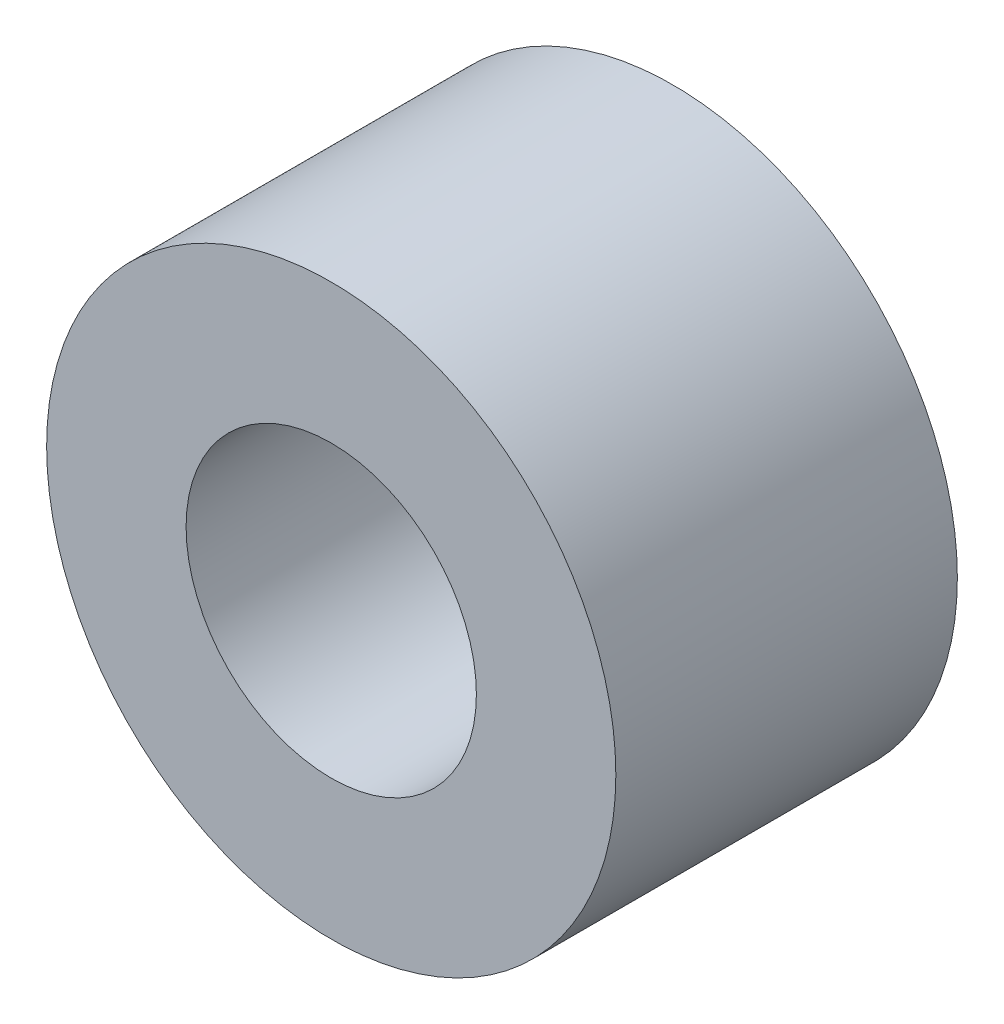
ISO-10303-21;
HEADER;
FILE_DESCRIPTION(('STEP AP214'),'2;1');
FILE_NAME('part.step','',(''),(''),'','','');
FILE_SCHEMA(('AUTOMOTIVE_DESIGN { 1 0 10303 214 1 1 1 1 }'));
ENDSEC;
DATA;
#1=APPLICATION_CONTEXT('core data for automotive mechanical design processes');
#2=APPLICATION_PROTOCOL_DEFINITION('international standard','automotive_design',2000,#1);
#3=PRODUCT_CONTEXT('',#1,'mechanical');
#4=PRODUCT('Part','Part','',(#3));
#5=PRODUCT_RELATED_PRODUCT_CATEGORY('part','',(#4));
#6=PRODUCT_DEFINITION_FORMATION('','',#4);
#7=PRODUCT_DEFINITION_CONTEXT('part definition',#1,'design');
#8=PRODUCT_DEFINITION('design','',#6,#7);
#9=PRODUCT_DEFINITION_SHAPE('','',#8);
#10=(LENGTH_UNIT() NAMED_UNIT(*) SI_UNIT(.MILLI.,.METRE.));
#11=(NAMED_UNIT(*) PLANE_ANGLE_UNIT() SI_UNIT($,.RADIAN.));
#12=(NAMED_UNIT(*) SI_UNIT($,.STERADIAN.) SOLID_ANGLE_UNIT());
#13=UNCERTAINTY_MEASURE_WITH_UNIT(LENGTH_MEASURE(1.E-05),#10,'distance_accuracy_value','');
#14=(GEOMETRIC_REPRESENTATION_CONTEXT(3) GLOBAL_UNCERTAINTY_ASSIGNED_CONTEXT((#13)) GLOBAL_UNIT_ASSIGNED_CONTEXT((#10,
#11,#12)) REPRESENTATION_CONTEXT('',''));
#15=CARTESIAN_POINT('',(0.,0.,0.));
#16=DIRECTION('',(0.,0.,1.));
#17=DIRECTION('',(1.,0.,0.));
#18=AXIS2_PLACEMENT_3D('',#15,#16,#17);
#19=CARTESIAN_POINT('',(0.,0.,6.));
#20=DIRECTION('',(0.,0.,1.));
#21=DIRECTION('',(1.,0.,0.));
#22=AXIS2_PLACEMENT_3D('',#19,#20,#21);
#23=PLANE('',#22);
#24=CARTESIAN_POINT('',(0.,0.,6.));
#25=DIRECTION('',(0.,0.,1.));
#26=DIRECTION('',(1.,0.,0.));
#27=AXIS2_PLACEMENT_3D('',#24,#25,#26);
#28=CIRCLE('',#27,5.);
#29=CARTESIAN_POINT('',(5.,0.,6.));
#30=VERTEX_POINT('',#29);
#31=EDGE_CURVE('E10',#30,#30,#28,.T.);
#32=ORIENTED_EDGE('',*,*,#31,.T.);
#33=EDGE_LOOP('',(#32));
#34=FACE_BOUND('',#33,.T.);
#35=CARTESIAN_POINT('',(0.,0.,6.));
#36=DIRECTION('',(0.,0.,1.));
#37=DIRECTION('',(1.,0.,0.));
#38=AXIS2_PLACEMENT_3D('',#35,#36,#37);
#39=CIRCLE('',#38,2.55);
#40=CARTESIAN_POINT('',(2.55,0.,6.));
#41=VERTEX_POINT('',#40);
#42=EDGE_CURVE('E53',#41,#41,#39,.T.);
#43=ORIENTED_EDGE('',*,*,#42,.F.);
#44=EDGE_LOOP('',(#43));
#45=FACE_BOUND('',#44,.T.);
#46=ADVANCED_FACE('F40',(#34,#45),#23,.T.);
#47=CARTESIAN_POINT('',(0.,0.,0.));
#48=DIRECTION('',(0.,0.,1.));
#49=DIRECTION('',(1.,0.,0.));
#50=AXIS2_PLACEMENT_3D('',#47,#48,#49);
#51=PLANE('',#50);
#52=CARTESIAN_POINT('',(0.,0.,0.));
#53=DIRECTION('',(0.,0.,1.));
#54=DIRECTION('',(1.,0.,0.));
#55=AXIS2_PLACEMENT_3D('',#52,#53,#54);
#56=CIRCLE('',#55,5.);
#57=CARTESIAN_POINT('',(5.,0.,0.));
#58=VERTEX_POINT('',#57);
#59=EDGE_CURVE('E44',#58,#58,#56,.T.);
#60=ORIENTED_EDGE('',*,*,#59,.F.);
#61=EDGE_LOOP('',(#60));
#62=FACE_BOUND('',#61,.T.);
#63=CARTESIAN_POINT('',(0.,0.,0.));
#64=DIRECTION('',(0.,0.,1.));
#65=DIRECTION('',(1.,0.,0.));
#66=AXIS2_PLACEMENT_3D('',#63,#64,#65);
#67=CIRCLE('',#66,2.55);
#68=CARTESIAN_POINT('',(2.55,0.,0.));
#69=VERTEX_POINT('',#68);
#70=EDGE_CURVE('E55',#69,#69,#67,.T.);
#71=ORIENTED_EDGE('',*,*,#70,.T.);
#72=EDGE_LOOP('',(#71));
#73=FACE_BOUND('',#72,.T.);
#74=ADVANCED_FACE('F67',(#62,#73),#51,.F.);
#75=CARTESIAN_POINT('',(0.,0.,6.));
#76=DIRECTION('',(0.,0.,-1.));
#77=DIRECTION('',(-1.,0.,0.));
#78=AXIS2_PLACEMENT_3D('',#75,#76,#77);
#79=CYLINDRICAL_SURFACE('',#78,5.);
#80=ORIENTED_EDGE('',*,*,#31,.F.);
#81=EDGE_LOOP('',(#80));
#82=FACE_BOUND('',#81,.T.);
#83=ORIENTED_EDGE('',*,*,#59,.T.);
#84=EDGE_LOOP('',(#83));
#85=FACE_BOUND('',#84,.T.);
#86=ADVANCED_FACE('F42',(#82,#85),#79,.T.);
#87=CARTESIAN_POINT('',(0.,0.,6.));
#88=DIRECTION('',(0.,0.,-1.));
#89=DIRECTION('',(-1.,0.,0.));
#90=AXIS2_PLACEMENT_3D('',#87,#88,#89);
#91=CYLINDRICAL_SURFACE('',#90,2.55);
#92=ORIENTED_EDGE('',*,*,#42,.T.);
#93=EDGE_LOOP('',(#92));
#94=FACE_BOUND('',#93,.T.);
#95=ORIENTED_EDGE('',*,*,#70,.F.);
#96=EDGE_LOOP('',(#95));
#97=FACE_BOUND('',#96,.T.);
#98=ADVANCED_FACE('F63',(#94,#97),#91,.F.);
#99=CLOSED_SHELL('',(#46,#74,#86,#98));
#100=MANIFOLD_SOLID_BREP('B2',#99);
#101=ADVANCED_BREP_SHAPE_REPRESENTATION('',(#18,#100),#14);
#102=SHAPE_DEFINITION_REPRESENTATION(#9,#101);
ENDSEC;
END-ISO-10303-21;
